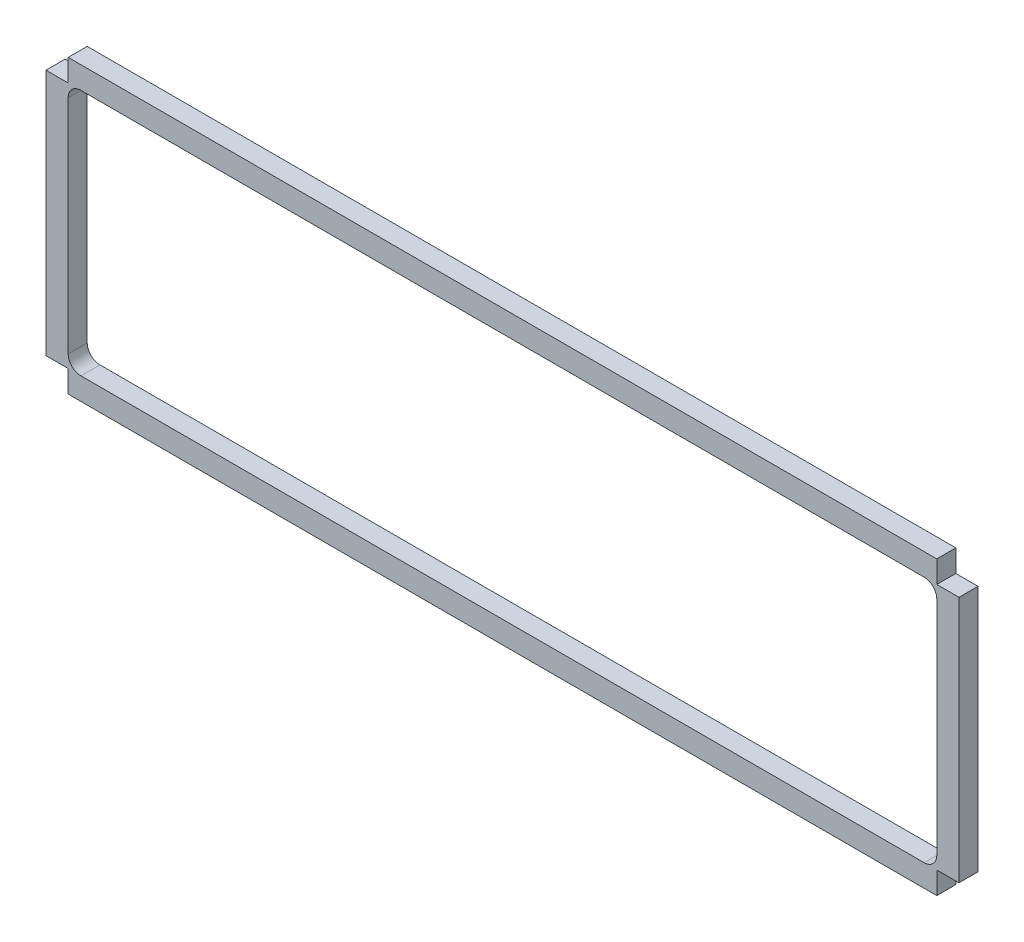
ISO-10303-21;
HEADER;
FILE_DESCRIPTION(('STEP AP214'),'2;1');
FILE_NAME('part.step','',(''),(''),'','','');
FILE_SCHEMA(('AUTOMOTIVE_DESIGN { 1 0 10303 214 1 1 1 1 }'));
ENDSEC;
DATA;
#1=APPLICATION_CONTEXT('core data for automotive mechanical design processes');
#2=APPLICATION_PROTOCOL_DEFINITION('international standard','automotive_design',2000,#1);
#3=PRODUCT_CONTEXT('',#1,'mechanical');
#4=PRODUCT('Part','Part','',(#3));
#5=PRODUCT_RELATED_PRODUCT_CATEGORY('part','',(#4));
#6=PRODUCT_DEFINITION_FORMATION('','',#4);
#7=PRODUCT_DEFINITION_CONTEXT('part definition',#1,'design');
#8=PRODUCT_DEFINITION('design','',#6,#7);
#9=PRODUCT_DEFINITION_SHAPE('','',#8);
#10=(LENGTH_UNIT() NAMED_UNIT(*) SI_UNIT(.MILLI.,.METRE.));
#11=(NAMED_UNIT(*) PLANE_ANGLE_UNIT() SI_UNIT($,.RADIAN.));
#12=(NAMED_UNIT(*) SI_UNIT($,.STERADIAN.) SOLID_ANGLE_UNIT());
#13=UNCERTAINTY_MEASURE_WITH_UNIT(LENGTH_MEASURE(1.E-05),#10,'distance_accuracy_value','');
#14=(GEOMETRIC_REPRESENTATION_CONTEXT(3) GLOBAL_UNCERTAINTY_ASSIGNED_CONTEXT((#13)) GLOBAL_UNIT_ASSIGNED_CONTEXT((#10,
#11,#12)) REPRESENTATION_CONTEXT('',''));
#15=CARTESIAN_POINT('',(0.,0.,0.));
#16=DIRECTION('',(0.,0.,1.));
#17=DIRECTION('',(1.,0.,0.));
#18=AXIS2_PLACEMENT_3D('',#15,#16,#17);
#19=CARTESIAN_POINT('',(72.,3.5,3.));
#20=DIRECTION('',(0.,1.,0.));
#21=DIRECTION('',(0.,0.,1.));
#22=AXIS2_PLACEMENT_3D('',#19,#20,#21);
#23=PLANE('',#22);
#24=DIRECTION('',(1.,0.,0.));
#25=VECTOR('',#24,1.);
#26=CARTESIAN_POINT('',(72.,3.5,0.));
#27=LINE('',#26,#25);
#28=CARTESIAN_POINT('',(68.5,3.5,0.));
#29=VERTEX_POINT('',#28);
#30=CARTESIAN_POINT('',(72.,3.5,0.));
#31=VERTEX_POINT('',#30);
#32=EDGE_CURVE('E230',#29,#31,#27,.T.);
#33=ORIENTED_EDGE('',*,*,#32,.T.);
#34=DIRECTION('',(0.,0.,-1.));
#35=VECTOR('',#34,1.);
#36=CARTESIAN_POINT('',(72.,3.5,3.));
#37=LINE('',#36,#35);
#38=CARTESIAN_POINT('',(72.,3.5,3.));
#39=VERTEX_POINT('',#38);
#40=EDGE_CURVE('E11',#39,#31,#37,.T.);
#41=ORIENTED_EDGE('',*,*,#40,.F.);
#42=DIRECTION('',(1.,0.,0.));
#43=VECTOR('',#42,1.);
#44=CARTESIAN_POINT('',(72.,3.5,3.));
#45=LINE('',#44,#43);
#46=CARTESIAN_POINT('',(68.5,3.5,3.));
#47=VERTEX_POINT('',#46);
#48=EDGE_CURVE('E232',#47,#39,#45,.T.);
#49=ORIENTED_EDGE('',*,*,#48,.F.);
#50=DIRECTION('',(0.,0.,-1.));
#51=VECTOR('',#50,1.);
#52=CARTESIAN_POINT('',(68.5,3.5,3.));
#53=LINE('',#52,#51);
#54=EDGE_CURVE('E258',#47,#29,#53,.T.);
#55=ORIENTED_EDGE('',*,*,#54,.T.);
#56=EDGE_LOOP('',(#33,#41,#49,#55));
#57=FACE_BOUND('',#56,.T.);
#58=ADVANCED_FACE('F43',(#57),#23,.F.);
#59=CARTESIAN_POINT('',(72.,42.5,3.));
#60=DIRECTION('',(-1.,0.,0.));
#61=DIRECTION('',(0.,-1.,0.));
#62=AXIS2_PLACEMENT_3D('',#59,#60,#61);
#63=PLANE('',#62);
#64=DIRECTION('',(0.,1.,0.));
#65=VECTOR('',#64,1.);
#66=CARTESIAN_POINT('',(72.,42.5,0.));
#67=LINE('',#66,#65);
#68=CARTESIAN_POINT('',(72.,42.5,0.));
#69=VERTEX_POINT('',#68);
#70=EDGE_CURVE('E261',#31,#69,#67,.T.);
#71=ORIENTED_EDGE('',*,*,#70,.T.);
#72=DIRECTION('',(0.,0.,-1.));
#73=VECTOR('',#72,1.);
#74=CARTESIAN_POINT('',(72.,42.5,3.));
#75=LINE('',#74,#73);
#76=CARTESIAN_POINT('',(72.,42.5,3.));
#77=VERTEX_POINT('',#76);
#78=EDGE_CURVE('E50',#77,#69,#75,.T.);
#79=ORIENTED_EDGE('',*,*,#78,.F.);
#80=DIRECTION('',(0.,1.,0.));
#81=VECTOR('',#80,1.);
#82=CARTESIAN_POINT('',(72.,42.5,3.));
#83=LINE('',#82,#81);
#84=EDGE_CURVE('E235',#39,#77,#83,.T.);
#85=ORIENTED_EDGE('',*,*,#84,.F.);
#86=ORIENTED_EDGE('',*,*,#40,.T.);
#87=EDGE_LOOP('',(#71,#79,#85,#86));
#88=FACE_BOUND('',#87,.T.);
#89=ADVANCED_FACE('F336',(#88),#63,.F.);
#90=CARTESIAN_POINT('',(68.5,42.5,3.));
#91=DIRECTION('',(0.,-1.,0.));
#92=DIRECTION('',(0.,0.,-1.));
#93=AXIS2_PLACEMENT_3D('',#90,#91,#92);
#94=PLANE('',#93);
#95=DIRECTION('',(-1.,0.,0.));
#96=VECTOR('',#95,1.);
#97=CARTESIAN_POINT('',(68.5,42.5,0.));
#98=LINE('',#97,#96);
#99=CARTESIAN_POINT('',(68.5,42.5,0.));
#100=VERTEX_POINT('',#99);
#101=EDGE_CURVE('E263',#69,#100,#98,.T.);
#102=ORIENTED_EDGE('',*,*,#101,.T.);
#103=DIRECTION('',(0.,0.,-1.));
#104=VECTOR('',#103,1.);
#105=CARTESIAN_POINT('',(68.5,42.5,3.));
#106=LINE('',#105,#104);
#107=CARTESIAN_POINT('',(68.5,42.5,3.));
#108=VERTEX_POINT('',#107);
#109=EDGE_CURVE('E308',#108,#100,#106,.T.);
#110=ORIENTED_EDGE('',*,*,#109,.F.);
#111=DIRECTION('',(-1.,0.,0.));
#112=VECTOR('',#111,1.);
#113=CARTESIAN_POINT('',(68.5,42.5,3.));
#114=LINE('',#113,#112);
#115=EDGE_CURVE('E238',#77,#108,#114,.T.);
#116=ORIENTED_EDGE('',*,*,#115,.F.);
#117=ORIENTED_EDGE('',*,*,#78,.T.);
#118=EDGE_LOOP('',(#102,#110,#116,#117));
#119=FACE_BOUND('',#118,.T.);
#120=ADVANCED_FACE('F315',(#119),#94,.F.);
#121=CARTESIAN_POINT('',(68.5,46.,3.));
#122=DIRECTION('',(-1.,0.,0.));
#123=DIRECTION('',(0.,0.,1.));
#124=AXIS2_PLACEMENT_3D('',#121,#122,#123);
#125=PLANE('',#124);
#126=DIRECTION('',(0.,1.,0.));
#127=VECTOR('',#126,1.);
#128=CARTESIAN_POINT('',(68.5,46.,0.));
#129=LINE('',#128,#127);
#130=CARTESIAN_POINT('',(68.5,46.,0.));
#131=VERTEX_POINT('',#130);
#132=EDGE_CURVE('E265',#100,#131,#129,.T.);
#133=ORIENTED_EDGE('',*,*,#132,.T.);
#134=DIRECTION('',(0.,0.,-1.));
#135=VECTOR('',#134,1.);
#136=CARTESIAN_POINT('',(68.5,46.,3.));
#137=LINE('',#136,#135);
#138=CARTESIAN_POINT('',(68.5,46.,3.));
#139=VERTEX_POINT('',#138);
#140=EDGE_CURVE('E305',#139,#131,#137,.T.);
#141=ORIENTED_EDGE('',*,*,#140,.F.);
#142=DIRECTION('',(0.,1.,0.));
#143=VECTOR('',#142,1.);
#144=CARTESIAN_POINT('',(68.5,46.,3.));
#145=LINE('',#144,#143);
#146=EDGE_CURVE('E240',#108,#139,#145,.T.);
#147=ORIENTED_EDGE('',*,*,#146,.F.);
#148=ORIENTED_EDGE('',*,*,#109,.T.);
#149=EDGE_LOOP('',(#133,#141,#147,#148));
#150=FACE_BOUND('',#149,.T.);
#151=ADVANCED_FACE('F326',(#150),#125,.F.);
#152=CARTESIAN_POINT('',(68.5,46.,3.));
#153=DIRECTION('',(0.,-1.,0.));
#154=DIRECTION('',(0.,0.,-1.));
#155=AXIS2_PLACEMENT_3D('',#152,#153,#154);
#156=PLANE('',#155);
#157=DIRECTION('',(-1.,0.,0.));
#158=VECTOR('',#157,1.);
#159=CARTESIAN_POINT('',(68.5,46.,0.));
#160=LINE('',#159,#158);
#161=CARTESIAN_POINT('',(-68.5,46.,0.));
#162=VERTEX_POINT('',#161);
#163=EDGE_CURVE('E267',#131,#162,#160,.T.);
#164=ORIENTED_EDGE('',*,*,#163,.T.);
#165=DIRECTION('',(0.,0.,-1.));
#166=VECTOR('',#165,1.);
#167=CARTESIAN_POINT('',(-68.5,46.,3.));
#168=LINE('',#167,#166);
#169=CARTESIAN_POINT('',(-68.5,46.,3.));
#170=VERTEX_POINT('',#169);
#171=EDGE_CURVE('E302',#170,#162,#168,.T.);
#172=ORIENTED_EDGE('',*,*,#171,.F.);
#173=DIRECTION('',(-1.,0.,0.));
#174=VECTOR('',#173,1.);
#175=CARTESIAN_POINT('',(68.5,46.,3.));
#176=LINE('',#175,#174);
#177=EDGE_CURVE('E242',#139,#170,#176,.T.);
#178=ORIENTED_EDGE('',*,*,#177,.F.);
#179=ORIENTED_EDGE('',*,*,#140,.T.);
#180=EDGE_LOOP('',(#164,#172,#178,#179));
#181=FACE_BOUND('',#180,.T.);
#182=ADVANCED_FACE('F330',(#181),#156,.F.);
#183=CARTESIAN_POINT('',(-68.5,46.,3.));
#184=DIRECTION('',(1.,0.,0.));
#185=DIRECTION('',(0.,0.,-1.));
#186=AXIS2_PLACEMENT_3D('',#183,#184,#185);
#187=PLANE('',#186);
#188=DIRECTION('',(0.,-1.,0.));
#189=VECTOR('',#188,1.);
#190=CARTESIAN_POINT('',(-68.5,46.,0.));
#191=LINE('',#190,#189);
#192=CARTESIAN_POINT('',(-68.5,42.5,0.));
#193=VERTEX_POINT('',#192);
#194=EDGE_CURVE('E269',#162,#193,#191,.T.);
#195=ORIENTED_EDGE('',*,*,#194,.T.);
#196=DIRECTION('',(0.,0.,-1.));
#197=VECTOR('',#196,1.);
#198=CARTESIAN_POINT('',(-68.5,42.5,3.));
#199=LINE('',#198,#197);
#200=CARTESIAN_POINT('',(-68.5,42.5,3.));
#201=VERTEX_POINT('',#200);
#202=EDGE_CURVE('E299',#201,#193,#199,.T.);
#203=ORIENTED_EDGE('',*,*,#202,.F.);
#204=DIRECTION('',(0.,-1.,0.));
#205=VECTOR('',#204,1.);
#206=CARTESIAN_POINT('',(-68.5,46.,3.));
#207=LINE('',#206,#205);
#208=EDGE_CURVE('E244',#170,#201,#207,.T.);
#209=ORIENTED_EDGE('',*,*,#208,.F.);
#210=ORIENTED_EDGE('',*,*,#171,.T.);
#211=EDGE_LOOP('',(#195,#203,#209,#210));
#212=FACE_BOUND('',#211,.T.);
#213=ADVANCED_FACE('F369',(#212),#187,.F.);
#214=CARTESIAN_POINT('',(-68.5,42.5,3.));
#215=DIRECTION('',(0.,-1.,0.));
#216=DIRECTION('',(0.,0.,-1.));
#217=AXIS2_PLACEMENT_3D('',#214,#215,#216);
#218=PLANE('',#217);
#219=DIRECTION('',(-1.,0.,0.));
#220=VECTOR('',#219,1.);
#221=CARTESIAN_POINT('',(-68.5,42.5,0.));
#222=LINE('',#221,#220);
#223=CARTESIAN_POINT('',(-72.,42.5,0.));
#224=VERTEX_POINT('',#223);
#225=EDGE_CURVE('E271',#193,#224,#222,.T.);
#226=ORIENTED_EDGE('',*,*,#225,.T.);
#227=DIRECTION('',(0.,0.,-1.));
#228=VECTOR('',#227,1.);
#229=CARTESIAN_POINT('',(-72.,42.5,3.));
#230=LINE('',#229,#228);
#231=CARTESIAN_POINT('',(-72.,42.5,3.));
#232=VERTEX_POINT('',#231);
#233=EDGE_CURVE('E296',#232,#224,#230,.T.);
#234=ORIENTED_EDGE('',*,*,#233,.F.);
#235=DIRECTION('',(-1.,0.,0.));
#236=VECTOR('',#235,1.);
#237=CARTESIAN_POINT('',(-68.5,42.5,3.));
#238=LINE('',#237,#236);
#239=EDGE_CURVE('E246',#201,#232,#238,.T.);
#240=ORIENTED_EDGE('',*,*,#239,.F.);
#241=ORIENTED_EDGE('',*,*,#202,.T.);
#242=EDGE_LOOP('',(#226,#234,#240,#241));
#243=FACE_BOUND('',#242,.T.);
#244=ADVANCED_FACE('F367',(#243),#218,.F.);
#245=CARTESIAN_POINT('',(-72.,42.5,3.));
#246=DIRECTION('',(1.,0.,0.));
#247=DIRECTION('',(0.,1.,0.));
#248=AXIS2_PLACEMENT_3D('',#245,#246,#247);
#249=PLANE('',#248);
#250=DIRECTION('',(0.,-1.,0.));
#251=VECTOR('',#250,1.);
#252=CARTESIAN_POINT('',(-72.,42.5,0.));
#253=LINE('',#252,#251);
#254=CARTESIAN_POINT('',(-72.,3.5,0.));
#255=VERTEX_POINT('',#254);
#256=EDGE_CURVE('E273',#224,#255,#253,.T.);
#257=ORIENTED_EDGE('',*,*,#256,.T.);
#258=DIRECTION('',(0.,0.,-1.));
#259=VECTOR('',#258,1.);
#260=CARTESIAN_POINT('',(-72.,3.5,3.));
#261=LINE('',#260,#259);
#262=CARTESIAN_POINT('',(-72.,3.5,3.));
#263=VERTEX_POINT('',#262);
#264=EDGE_CURVE('E293',#263,#255,#261,.T.);
#265=ORIENTED_EDGE('',*,*,#264,.F.);
#266=DIRECTION('',(0.,-1.,0.));
#267=VECTOR('',#266,1.);
#268=CARTESIAN_POINT('',(-72.,42.5,3.));
#269=LINE('',#268,#267);
#270=EDGE_CURVE('E248',#232,#263,#269,.T.);
#271=ORIENTED_EDGE('',*,*,#270,.F.);
#272=ORIENTED_EDGE('',*,*,#233,.T.);
#273=EDGE_LOOP('',(#257,#265,#271,#272));
#274=FACE_BOUND('',#273,.T.);
#275=ADVANCED_FACE('F363',(#274),#249,.F.);
#276=CARTESIAN_POINT('',(-72.,3.5,3.));
#277=DIRECTION('',(0.,1.,0.));
#278=DIRECTION('',(0.,0.,1.));
#279=AXIS2_PLACEMENT_3D('',#276,#277,#278);
#280=PLANE('',#279);
#281=DIRECTION('',(1.,0.,0.));
#282=VECTOR('',#281,1.);
#283=CARTESIAN_POINT('',(-72.,3.5,0.));
#284=LINE('',#283,#282);
#285=CARTESIAN_POINT('',(-68.5,3.5,0.));
#286=VERTEX_POINT('',#285);
#287=EDGE_CURVE('E275',#255,#286,#284,.T.);
#288=ORIENTED_EDGE('',*,*,#287,.T.);
#289=DIRECTION('',(0.,0.,-1.));
#290=VECTOR('',#289,1.);
#291=CARTESIAN_POINT('',(-68.5,3.5,3.));
#292=LINE('',#291,#290);
#293=CARTESIAN_POINT('',(-68.5,3.5,3.));
#294=VERTEX_POINT('',#293);
#295=EDGE_CURVE('E290',#294,#286,#292,.T.);
#296=ORIENTED_EDGE('',*,*,#295,.F.);
#297=DIRECTION('',(1.,0.,0.));
#298=VECTOR('',#297,1.);
#299=CARTESIAN_POINT('',(-72.,3.5,3.));
#300=LINE('',#299,#298);
#301=EDGE_CURVE('E250',#263,#294,#300,.T.);
#302=ORIENTED_EDGE('',*,*,#301,.F.);
#303=ORIENTED_EDGE('',*,*,#264,.T.);
#304=EDGE_LOOP('',(#288,#296,#302,#303));
#305=FACE_BOUND('',#304,.T.);
#306=ADVANCED_FACE('F358',(#305),#280,.F.);
#307=CARTESIAN_POINT('',(-68.5,3.5,3.));
#308=DIRECTION('',(1.,0.,0.));
#309=DIRECTION('',(0.,1.,0.));
#310=AXIS2_PLACEMENT_3D('',#307,#308,#309);
#311=PLANE('',#310);
#312=DIRECTION('',(0.,-1.,0.));
#313=VECTOR('',#312,1.);
#314=CARTESIAN_POINT('',(-68.5,3.5,0.));
#315=LINE('',#314,#313);
#316=CARTESIAN_POINT('',(-68.5,0.,0.));
#317=VERTEX_POINT('',#316);
#318=EDGE_CURVE('E277',#286,#317,#315,.T.);
#319=ORIENTED_EDGE('',*,*,#318,.T.);
#320=DIRECTION('',(0.,0.,-1.));
#321=VECTOR('',#320,1.);
#322=CARTESIAN_POINT('',(-68.5,0.,3.));
#323=LINE('',#322,#321);
#324=CARTESIAN_POINT('',(-68.5,0.,3.));
#325=VERTEX_POINT('',#324);
#326=EDGE_CURVE('E287',#325,#317,#323,.T.);
#327=ORIENTED_EDGE('',*,*,#326,.F.);
#328=DIRECTION('',(0.,-1.,0.));
#329=VECTOR('',#328,1.);
#330=CARTESIAN_POINT('',(-68.5,3.5,3.));
#331=LINE('',#330,#329);
#332=EDGE_CURVE('E252',#294,#325,#331,.T.);
#333=ORIENTED_EDGE('',*,*,#332,.F.);
#334=ORIENTED_EDGE('',*,*,#295,.T.);
#335=EDGE_LOOP('',(#319,#327,#333,#334));
#336=FACE_BOUND('',#335,.T.);
#337=ADVANCED_FACE('F352',(#336),#311,.F.);
#338=CARTESIAN_POINT('',(-68.5,0.,3.));
#339=DIRECTION('',(0.,1.,0.));
#340=DIRECTION('',(0.,0.,1.));
#341=AXIS2_PLACEMENT_3D('',#338,#339,#340);
#342=PLANE('',#341);
#343=DIRECTION('',(1.,0.,0.));
#344=VECTOR('',#343,1.);
#345=CARTESIAN_POINT('',(-68.5,0.,0.));
#346=LINE('',#345,#344);
#347=CARTESIAN_POINT('',(68.5,0.,0.));
#348=VERTEX_POINT('',#347);
#349=EDGE_CURVE('E279',#317,#348,#346,.T.);
#350=ORIENTED_EDGE('',*,*,#349,.T.);
#351=DIRECTION('',(0.,0.,-1.));
#352=VECTOR('',#351,1.);
#353=CARTESIAN_POINT('',(68.5,0.,3.));
#354=LINE('',#353,#352);
#355=CARTESIAN_POINT('',(68.5,0.,3.));
#356=VERTEX_POINT('',#355);
#357=EDGE_CURVE('E284',#356,#348,#354,.T.);
#358=ORIENTED_EDGE('',*,*,#357,.F.);
#359=DIRECTION('',(1.,0.,0.));
#360=VECTOR('',#359,1.);
#361=CARTESIAN_POINT('',(-68.5,0.,3.));
#362=LINE('',#361,#360);
#363=EDGE_CURVE('E254',#325,#356,#362,.T.);
#364=ORIENTED_EDGE('',*,*,#363,.F.);
#365=ORIENTED_EDGE('',*,*,#326,.T.);
#366=EDGE_LOOP('',(#350,#358,#364,#365));
#367=FACE_BOUND('',#366,.T.);
#368=ADVANCED_FACE('F348',(#367),#342,.F.);
#369=CARTESIAN_POINT('',(68.5,3.5,3.));
#370=DIRECTION('',(-1.,0.,0.));
#371=DIRECTION('',(0.,-1.,0.));
#372=AXIS2_PLACEMENT_3D('',#369,#370,#371);
#373=PLANE('',#372);
#374=DIRECTION('',(0.,1.,0.));
#375=VECTOR('',#374,1.);
#376=CARTESIAN_POINT('',(68.5,3.5,0.));
#377=LINE('',#376,#375);
#378=EDGE_CURVE('E236',#348,#29,#377,.T.);
#379=ORIENTED_EDGE('',*,*,#378,.T.);
#380=ORIENTED_EDGE('',*,*,#54,.F.);
#381=DIRECTION('',(0.,1.,0.));
#382=VECTOR('',#381,1.);
#383=CARTESIAN_POINT('',(68.5,3.5,3.));
#384=LINE('',#383,#382);
#385=EDGE_CURVE('E256',#356,#47,#384,.T.);
#386=ORIENTED_EDGE('',*,*,#385,.F.);
#387=ORIENTED_EDGE('',*,*,#357,.T.);
#388=EDGE_LOOP('',(#379,#380,#386,#387));
#389=FACE_BOUND('',#388,.T.);
#390=ADVANCED_FACE('F343',(#389),#373,.F.);
#391=CARTESIAN_POINT('',(0.,0.,3.));
#392=DIRECTION('',(0.,0.,1.));
#393=DIRECTION('',(1.,0.,0.));
#394=AXIS2_PLACEMENT_3D('',#391,#392,#393);
#395=PLANE('',#394);
#396=DIRECTION('',(1.,0.,0.));
#397=VECTOR('',#396,1.);
#398=CARTESIAN_POINT('',(-66.5,3.5,3.));
#399=LINE('',#398,#397);
#400=CARTESIAN_POINT('',(-66.5,3.5,3.));
#401=VERTEX_POINT('',#400);
#402=CARTESIAN_POINT('',(66.5,3.5,3.));
#403=VERTEX_POINT('',#402);
#404=EDGE_CURVE('E57',#401,#403,#399,.T.);
#405=ORIENTED_EDGE('',*,*,#404,.F.);
#406=CARTESIAN_POINT('',(-66.5,5.5,3.));
#407=DIRECTION('',(0.,0.,1.));
#408=DIRECTION('',(1.,0.,0.));
#409=AXIS2_PLACEMENT_3D('',#406,#407,#408);
#410=CIRCLE('',#409,2.);
#411=CARTESIAN_POINT('',(-68.5,5.5,3.));
#412=VERTEX_POINT('',#411);
#413=EDGE_CURVE('E213',#412,#401,#410,.T.);
#414=ORIENTED_EDGE('',*,*,#413,.F.);
#415=DIRECTION('',(0.,-1.,0.));
#416=VECTOR('',#415,1.);
#417=CARTESIAN_POINT('',(-68.5,40.5,3.));
#418=LINE('',#417,#416);
#419=CARTESIAN_POINT('',(-68.5,40.5,3.));
#420=VERTEX_POINT('',#419);
#421=EDGE_CURVE('E210',#420,#412,#418,.T.);
#422=ORIENTED_EDGE('',*,*,#421,.F.);
#423=CARTESIAN_POINT('',(-66.5,40.5,3.));
#424=DIRECTION('',(0.,0.,1.));
#425=DIRECTION('',(1.,0.,0.));
#426=AXIS2_PLACEMENT_3D('',#423,#424,#425);
#427=CIRCLE('',#426,2.);
#428=CARTESIAN_POINT('',(-66.5,42.5,3.));
#429=VERTEX_POINT('',#428);
#430=EDGE_CURVE('E207',#429,#420,#427,.T.);
#431=ORIENTED_EDGE('',*,*,#430,.F.);
#432=DIRECTION('',(-1.,0.,0.));
#433=VECTOR('',#432,1.);
#434=CARTESIAN_POINT('',(66.5,42.5,3.));
#435=LINE('',#434,#433);
#436=CARTESIAN_POINT('',(66.5,42.5,3.));
#437=VERTEX_POINT('',#436);
#438=EDGE_CURVE('E201',#437,#429,#435,.T.);
#439=ORIENTED_EDGE('',*,*,#438,.F.);
#440=CARTESIAN_POINT('',(66.5,40.5,3.));
#441=DIRECTION('',(0.,0.,1.));
#442=DIRECTION('',(1.,0.,0.));
#443=AXIS2_PLACEMENT_3D('',#440,#441,#442);
#444=CIRCLE('',#443,2.);
#445=CARTESIAN_POINT('',(68.5,40.5,3.));
#446=VERTEX_POINT('',#445);
#447=EDGE_CURVE('E199',#446,#437,#444,.T.);
#448=ORIENTED_EDGE('',*,*,#447,.F.);
#449=DIRECTION('',(0.,1.,0.));
#450=VECTOR('',#449,1.);
#451=CARTESIAN_POINT('',(68.5,5.5,3.));
#452=LINE('',#451,#450);
#453=CARTESIAN_POINT('',(68.5,5.5,3.));
#454=VERTEX_POINT('',#453);
#455=EDGE_CURVE('E182',#454,#446,#452,.T.);
#456=ORIENTED_EDGE('',*,*,#455,.F.);
#457=CARTESIAN_POINT('',(66.5,5.5,3.));
#458=DIRECTION('',(0.,0.,1.));
#459=DIRECTION('',(1.,0.,0.));
#460=AXIS2_PLACEMENT_3D('',#457,#458,#459);
#461=CIRCLE('',#460,2.);
#462=EDGE_CURVE('E191',#403,#454,#461,.T.);
#463=ORIENTED_EDGE('',*,*,#462,.F.);
#464=EDGE_LOOP('',(#405,#414,#422,#431,#439,#448,#456,#463));
#465=FACE_BOUND('',#464,.T.);
#466=ORIENTED_EDGE('',*,*,#48,.T.);
#467=ORIENTED_EDGE('',*,*,#84,.T.);
#468=ORIENTED_EDGE('',*,*,#115,.T.);
#469=ORIENTED_EDGE('',*,*,#146,.T.);
#470=ORIENTED_EDGE('',*,*,#177,.T.);
#471=ORIENTED_EDGE('',*,*,#208,.T.);
#472=ORIENTED_EDGE('',*,*,#239,.T.);
#473=ORIENTED_EDGE('',*,*,#270,.T.);
#474=ORIENTED_EDGE('',*,*,#301,.T.);
#475=ORIENTED_EDGE('',*,*,#332,.T.);
#476=ORIENTED_EDGE('',*,*,#363,.T.);
#477=ORIENTED_EDGE('',*,*,#385,.T.);
#478=EDGE_LOOP('',(#466,#467,#468,#469,#470,#471,#472,#473,#474,#475,#476,#477));
#479=FACE_BOUND('',#478,.T.);
#480=ADVANCED_FACE('F195',(#465,#479),#395,.T.);
#481=CARTESIAN_POINT('',(0.,0.,0.));
#482=DIRECTION('',(0.,0.,1.));
#483=DIRECTION('',(1.,0.,0.));
#484=AXIS2_PLACEMENT_3D('',#481,#482,#483);
#485=PLANE('',#484);
#486=CARTESIAN_POINT('',(-66.5,5.5,0.));
#487=DIRECTION('',(0.,0.,1.));
#488=DIRECTION('',(1.,0.,0.));
#489=AXIS2_PLACEMENT_3D('',#486,#487,#488);
#490=CIRCLE('',#489,2.);
#491=CARTESIAN_POINT('',(-66.5,3.5,0.));
#492=VERTEX_POINT('',#491);
#493=CARTESIAN_POINT('',(-68.5,5.5,0.));
#494=VERTEX_POINT('',#493);
#495=EDGE_CURVE('E521',#492,#494,#490,.F.);
#496=ORIENTED_EDGE('',*,*,#495,.F.);
#497=DIRECTION('',(-1.,0.,0.));
#498=VECTOR('',#497,1.);
#499=CARTESIAN_POINT('',(-66.5,3.5,0.));
#500=LINE('',#499,#498);
#501=CARTESIAN_POINT('',(66.5,3.5,0.));
#502=VERTEX_POINT('',#501);
#503=EDGE_CURVE('E231',#502,#492,#500,.T.);
#504=ORIENTED_EDGE('',*,*,#503,.F.);
#505=CARTESIAN_POINT('',(66.5,5.5,0.));
#506=DIRECTION('',(0.,0.,1.));
#507=DIRECTION('',(1.,0.,0.));
#508=AXIS2_PLACEMENT_3D('',#505,#506,#507);
#509=CIRCLE('',#508,2.);
#510=CARTESIAN_POINT('',(68.5,5.5,0.));
#511=VERTEX_POINT('',#510);
#512=EDGE_CURVE('E228',#511,#502,#509,.F.);
#513=ORIENTED_EDGE('',*,*,#512,.F.);
#514=DIRECTION('',(0.,-1.,0.));
#515=VECTOR('',#514,1.);
#516=CARTESIAN_POINT('',(68.5,5.5,0.));
#517=LINE('',#516,#515);
#518=CARTESIAN_POINT('',(68.5,40.5,0.));
#519=VERTEX_POINT('',#518);
#520=EDGE_CURVE('E185',#519,#511,#517,.T.);
#521=ORIENTED_EDGE('',*,*,#520,.F.);
#522=CARTESIAN_POINT('',(66.5,40.5,0.));
#523=DIRECTION('',(0.,0.,1.));
#524=DIRECTION('',(1.,0.,0.));
#525=AXIS2_PLACEMENT_3D('',#522,#523,#524);
#526=CIRCLE('',#525,2.);
#527=CARTESIAN_POINT('',(66.5,42.5,0.));
#528=VERTEX_POINT('',#527);
#529=EDGE_CURVE('E508',#528,#519,#526,.F.);
#530=ORIENTED_EDGE('',*,*,#529,.F.);
#531=DIRECTION('',(1.,0.,0.));
#532=VECTOR('',#531,1.);
#533=CARTESIAN_POINT('',(66.5,42.5,0.));
#534=LINE('',#533,#532);
#535=CARTESIAN_POINT('',(-66.5,42.5,0.));
#536=VERTEX_POINT('',#535);
#537=EDGE_CURVE('E510',#536,#528,#534,.T.);
#538=ORIENTED_EDGE('',*,*,#537,.F.);
#539=CARTESIAN_POINT('',(-66.5,40.5,0.));
#540=DIRECTION('',(0.,0.,1.));
#541=DIRECTION('',(1.,0.,0.));
#542=AXIS2_PLACEMENT_3D('',#539,#540,#541);
#543=CIRCLE('',#542,2.);
#544=CARTESIAN_POINT('',(-68.5,40.5,0.));
#545=VERTEX_POINT('',#544);
#546=EDGE_CURVE('E517',#545,#536,#543,.F.);
#547=ORIENTED_EDGE('',*,*,#546,.F.);
#548=DIRECTION('',(0.,1.,0.));
#549=VECTOR('',#548,1.);
#550=CARTESIAN_POINT('',(-68.5,40.5,0.));
#551=LINE('',#550,#549);
#552=EDGE_CURVE('E519',#494,#545,#551,.T.);
#553=ORIENTED_EDGE('',*,*,#552,.F.);
#554=EDGE_LOOP('',(#496,#504,#513,#521,#530,#538,#547,#553));
#555=FACE_BOUND('',#554,.T.);
#556=ORIENTED_EDGE('',*,*,#32,.F.);
#557=ORIENTED_EDGE('',*,*,#378,.F.);
#558=ORIENTED_EDGE('',*,*,#349,.F.);
#559=ORIENTED_EDGE('',*,*,#318,.F.);
#560=ORIENTED_EDGE('',*,*,#287,.F.);
#561=ORIENTED_EDGE('',*,*,#256,.F.);
#562=ORIENTED_EDGE('',*,*,#225,.F.);
#563=ORIENTED_EDGE('',*,*,#194,.F.);
#564=ORIENTED_EDGE('',*,*,#163,.F.);
#565=ORIENTED_EDGE('',*,*,#132,.F.);
#566=ORIENTED_EDGE('',*,*,#101,.F.);
#567=ORIENTED_EDGE('',*,*,#70,.F.);
#568=EDGE_LOOP('',(#556,#557,#558,#559,#560,#561,#562,#563,#564,#565,#566,#567));
#569=FACE_BOUND('',#568,.T.);
#570=ADVANCED_FACE('F321',(#555,#569),#485,.F.);
#571=CARTESIAN_POINT('',(-66.5,3.5,-142.442971044555));
#572=DIRECTION('',(0.,-1.,0.));
#573=DIRECTION('',(0.,0.,-1.));
#574=AXIS2_PLACEMENT_3D('',#571,#572,#573);
#575=PLANE('',#574);
#576=ORIENTED_EDGE('',*,*,#503,.T.);
#577=DIRECTION('',(0.,0.,1.));
#578=VECTOR('',#577,1.);
#579=CARTESIAN_POINT('',(-66.5,3.5,-142.442971044555));
#580=LINE('',#579,#578);
#581=EDGE_CURVE('E216',#492,#401,#580,.T.);
#582=ORIENTED_EDGE('',*,*,#581,.T.);
#583=ORIENTED_EDGE('',*,*,#404,.T.);
#584=DIRECTION('',(0.,0.,1.));
#585=VECTOR('',#584,1.);
#586=CARTESIAN_POINT('',(66.5,3.5,-142.442971044555));
#587=LINE('',#586,#585);
#588=EDGE_CURVE('E188',#502,#403,#587,.T.);
#589=ORIENTED_EDGE('',*,*,#588,.F.);
#590=EDGE_LOOP('',(#576,#582,#583,#589));
#591=FACE_BOUND('',#590,.T.);
#592=ADVANCED_FACE('F445',(#591),#575,.F.);
#593=CARTESIAN_POINT('',(-66.5,5.5,-142.442971044555));
#594=DIRECTION('',(0.,0.,1.));
#595=DIRECTION('',(1.,0.,0.));
#596=AXIS2_PLACEMENT_3D('',#593,#594,#595);
#597=CYLINDRICAL_SURFACE('',#596,2.);
#598=ORIENTED_EDGE('',*,*,#495,.T.);
#599=DIRECTION('',(0.,0.,1.));
#600=VECTOR('',#599,1.);
#601=CARTESIAN_POINT('',(-68.5,5.5,-142.442971044555));
#602=LINE('',#601,#600);
#603=EDGE_CURVE('E218',#494,#412,#602,.T.);
#604=ORIENTED_EDGE('',*,*,#603,.T.);
#605=ORIENTED_EDGE('',*,*,#413,.T.);
#606=ORIENTED_EDGE('',*,*,#581,.F.);
#607=EDGE_LOOP('',(#598,#604,#605,#606));
#608=FACE_BOUND('',#607,.T.);
#609=ADVANCED_FACE('F453',(#608),#597,.F.);
#610=CARTESIAN_POINT('',(-68.5,40.5,-142.442971044555));
#611=DIRECTION('',(-1.,0.,0.));
#612=DIRECTION('',(0.,0.,1.));
#613=AXIS2_PLACEMENT_3D('',#610,#611,#612);
#614=PLANE('',#613);
#615=ORIENTED_EDGE('',*,*,#552,.T.);
#616=DIRECTION('',(0.,0.,1.));
#617=VECTOR('',#616,1.);
#618=CARTESIAN_POINT('',(-68.5,40.5,-142.442971044555));
#619=LINE('',#618,#617);
#620=EDGE_CURVE('E220',#545,#420,#619,.T.);
#621=ORIENTED_EDGE('',*,*,#620,.T.);
#622=ORIENTED_EDGE('',*,*,#421,.T.);
#623=ORIENTED_EDGE('',*,*,#603,.F.);
#624=EDGE_LOOP('',(#615,#621,#622,#623));
#625=FACE_BOUND('',#624,.T.);
#626=ADVANCED_FACE('F460',(#625),#614,.F.);
#627=CARTESIAN_POINT('',(-66.5,40.5,-142.442971044555));
#628=DIRECTION('',(0.,0.,1.));
#629=DIRECTION('',(1.,0.,0.));
#630=AXIS2_PLACEMENT_3D('',#627,#628,#629);
#631=CYLINDRICAL_SURFACE('',#630,2.);
#632=ORIENTED_EDGE('',*,*,#546,.T.);
#633=DIRECTION('',(0.,0.,1.));
#634=VECTOR('',#633,1.);
#635=CARTESIAN_POINT('',(-66.5,42.5,-142.442971044555));
#636=LINE('',#635,#634);
#637=EDGE_CURVE('E222',#536,#429,#636,.T.);
#638=ORIENTED_EDGE('',*,*,#637,.T.);
#639=ORIENTED_EDGE('',*,*,#430,.T.);
#640=ORIENTED_EDGE('',*,*,#620,.F.);
#641=EDGE_LOOP('',(#632,#638,#639,#640));
#642=FACE_BOUND('',#641,.T.);
#643=ADVANCED_FACE('F468',(#642),#631,.F.);
#644=CARTESIAN_POINT('',(66.5,42.5,-142.442971044555));
#645=DIRECTION('',(0.,1.,0.));
#646=DIRECTION('',(0.,0.,1.));
#647=AXIS2_PLACEMENT_3D('',#644,#645,#646);
#648=PLANE('',#647);
#649=ORIENTED_EDGE('',*,*,#537,.T.);
#650=DIRECTION('',(0.,0.,1.));
#651=VECTOR('',#650,1.);
#652=CARTESIAN_POINT('',(66.5,42.5,-142.442971044555));
#653=LINE('',#652,#651);
#654=EDGE_CURVE('E224',#528,#437,#653,.T.);
#655=ORIENTED_EDGE('',*,*,#654,.T.);
#656=ORIENTED_EDGE('',*,*,#438,.T.);
#657=ORIENTED_EDGE('',*,*,#637,.F.);
#658=EDGE_LOOP('',(#649,#655,#656,#657));
#659=FACE_BOUND('',#658,.T.);
#660=ADVANCED_FACE('F476',(#659),#648,.F.);
#661=CARTESIAN_POINT('',(66.5,40.5,-142.442971044555));
#662=DIRECTION('',(0.,0.,1.));
#663=DIRECTION('',(1.,0.,0.));
#664=AXIS2_PLACEMENT_3D('',#661,#662,#663);
#665=CYLINDRICAL_SURFACE('',#664,2.);
#666=ORIENTED_EDGE('',*,*,#529,.T.);
#667=DIRECTION('',(0.,0.,1.));
#668=VECTOR('',#667,1.);
#669=CARTESIAN_POINT('',(68.5,40.5,-142.442971044555));
#670=LINE('',#669,#668);
#671=EDGE_CURVE('E187',#519,#446,#670,.T.);
#672=ORIENTED_EDGE('',*,*,#671,.T.);
#673=ORIENTED_EDGE('',*,*,#447,.T.);
#674=ORIENTED_EDGE('',*,*,#654,.F.);
#675=EDGE_LOOP('',(#666,#672,#673,#674));
#676=FACE_BOUND('',#675,.T.);
#677=ADVANCED_FACE('F484',(#676),#665,.F.);
#678=CARTESIAN_POINT('',(68.5,5.5,-142.442971044555));
#679=DIRECTION('',(1.,0.,0.));
#680=DIRECTION('',(0.,0.,-1.));
#681=AXIS2_PLACEMENT_3D('',#678,#679,#680);
#682=PLANE('',#681);
#683=ORIENTED_EDGE('',*,*,#520,.T.);
#684=DIRECTION('',(0.,0.,1.));
#685=VECTOR('',#684,1.);
#686=CARTESIAN_POINT('',(68.5,5.5,-142.442971044555));
#687=LINE('',#686,#685);
#688=EDGE_CURVE('E65',#511,#454,#687,.T.);
#689=ORIENTED_EDGE('',*,*,#688,.T.);
#690=ORIENTED_EDGE('',*,*,#455,.T.);
#691=ORIENTED_EDGE('',*,*,#671,.F.);
#692=EDGE_LOOP('',(#683,#689,#690,#691));
#693=FACE_BOUND('',#692,.T.);
#694=ADVANCED_FACE('F179',(#693),#682,.F.);
#695=CARTESIAN_POINT('',(66.5,5.5,-142.442971044555));
#696=DIRECTION('',(0.,0.,1.));
#697=DIRECTION('',(1.,0.,0.));
#698=AXIS2_PLACEMENT_3D('',#695,#696,#697);
#699=CYLINDRICAL_SURFACE('',#698,2.);
#700=ORIENTED_EDGE('',*,*,#512,.T.);
#701=ORIENTED_EDGE('',*,*,#588,.T.);
#702=ORIENTED_EDGE('',*,*,#462,.T.);
#703=ORIENTED_EDGE('',*,*,#688,.F.);
#704=EDGE_LOOP('',(#700,#701,#702,#703));
#705=FACE_BOUND('',#704,.T.);
#706=ADVANCED_FACE('F192',(#705),#699,.F.);
#707=CLOSED_SHELL('',(#58,#89,#120,#151,#182,#213,#244,#275,#306,#337,#368,#390,#480,#570,#592,
#609,#626,#643,#660,#677,#694,#706));
#708=MANIFOLD_SOLID_BREP('B2',#707);
#709=ADVANCED_BREP_SHAPE_REPRESENTATION('',(#18,#708),#14);
#710=SHAPE_DEFINITION_REPRESENTATION(#9,#709);
ENDSEC;
END-ISO-10303-21;
